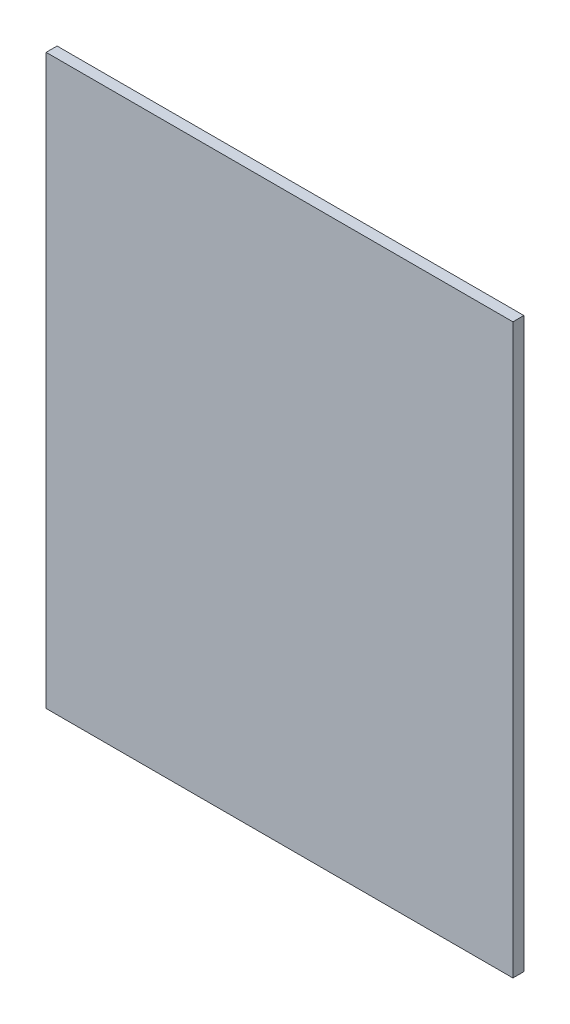
ISO-10303-21;
HEADER;
FILE_DESCRIPTION(('STEP AP214'),'2;1');
FILE_NAME('part.step','',(''),(''),'','','');
FILE_SCHEMA(('AUTOMOTIVE_DESIGN { 1 0 10303 214 1 1 1 1 }'));
ENDSEC;
DATA;
#1=APPLICATION_CONTEXT('core data for automotive mechanical design processes');
#2=APPLICATION_PROTOCOL_DEFINITION('international standard','automotive_design',2000,#1);
#3=PRODUCT_CONTEXT('',#1,'mechanical');
#4=PRODUCT('Part','Part','',(#3));
#5=PRODUCT_RELATED_PRODUCT_CATEGORY('part','',(#4));
#6=PRODUCT_DEFINITION_FORMATION('','',#4);
#7=PRODUCT_DEFINITION_CONTEXT('part definition',#1,'design');
#8=PRODUCT_DEFINITION('design','',#6,#7);
#9=PRODUCT_DEFINITION_SHAPE('','',#8);
#10=(LENGTH_UNIT() NAMED_UNIT(*) SI_UNIT(.MILLI.,.METRE.));
#11=(NAMED_UNIT(*) PLANE_ANGLE_UNIT() SI_UNIT($,.RADIAN.));
#12=(NAMED_UNIT(*) SI_UNIT($,.STERADIAN.) SOLID_ANGLE_UNIT());
#13=UNCERTAINTY_MEASURE_WITH_UNIT(LENGTH_MEASURE(1.E-05),#10,'distance_accuracy_value','');
#14=(GEOMETRIC_REPRESENTATION_CONTEXT(3) GLOBAL_UNCERTAINTY_ASSIGNED_CONTEXT((#13)) GLOBAL_UNIT_ASSIGNED_CONTEXT((#10,
#11,#12)) REPRESENTATION_CONTEXT('',''));
#15=CARTESIAN_POINT('',(0.,0.,0.));
#16=DIRECTION('',(0.,0.,1.));
#17=DIRECTION('',(1.,0.,0.));
#18=AXIS2_PLACEMENT_3D('',#15,#16,#17);
#19=CARTESIAN_POINT('',(151.884088258819,-292.926224711825,2.7));
#20=DIRECTION('',(-1.,0.,0.));
#21=DIRECTION('',(0.,0.,1.));
#22=AXIS2_PLACEMENT_3D('',#19,#20,#21);
#23=PLANE('',#22);
#24=DIRECTION('',(0.,1.,0.));
#25=VECTOR('',#24,1.);
#26=CARTESIAN_POINT('',(151.884088258819,-292.926224711825,0.));
#27=LINE('',#26,#25);
#28=CARTESIAN_POINT('',(151.884088258819,-432.926224711825,0.));
#29=VERTEX_POINT('',#28);
#30=CARTESIAN_POINT('',(151.884088258819,-292.926224711825,0.));
#31=VERTEX_POINT('',#30);
#32=EDGE_CURVE('E96',#29,#31,#27,.T.);
#33=ORIENTED_EDGE('',*,*,#32,.T.);
#34=DIRECTION('',(0.,0.,-1.));
#35=VECTOR('',#34,1.);
#36=CARTESIAN_POINT('',(151.884088258819,-292.926224711825,2.7));
#37=LINE('',#36,#35);
#38=CARTESIAN_POINT('',(151.884088258819,-292.926224711825,2.7));
#39=VERTEX_POINT('',#38);
#40=EDGE_CURVE('E11',#39,#31,#37,.T.);
#41=ORIENTED_EDGE('',*,*,#40,.F.);
#42=DIRECTION('',(0.,1.,0.));
#43=VECTOR('',#42,1.);
#44=CARTESIAN_POINT('',(151.884088258819,-292.926224711825,2.7));
#45=LINE('',#44,#43);
#46=CARTESIAN_POINT('',(151.884088258819,-432.926224711825,2.7));
#47=VERTEX_POINT('',#46);
#48=EDGE_CURVE('E84',#47,#39,#45,.T.);
#49=ORIENTED_EDGE('',*,*,#48,.F.);
#50=DIRECTION('',(0.,0.,-1.));
#51=VECTOR('',#50,1.);
#52=CARTESIAN_POINT('',(151.884088258819,-432.926224711825,2.7));
#53=LINE('',#52,#51);
#54=EDGE_CURVE('E92',#47,#29,#53,.T.);
#55=ORIENTED_EDGE('',*,*,#54,.T.);
#56=EDGE_LOOP('',(#33,#41,#49,#55));
#57=FACE_BOUND('',#56,.T.);
#58=ADVANCED_FACE('F33',(#57),#23,.F.);
#59=CARTESIAN_POINT('',(151.884088258819,-292.926224711825,2.7));
#60=DIRECTION('',(0.,-1.,0.));
#61=DIRECTION('',(0.,0.,-1.));
#62=AXIS2_PLACEMENT_3D('',#59,#60,#61);
#63=PLANE('',#62);
#64=DIRECTION('',(-1.,0.,0.));
#65=VECTOR('',#64,1.);
#66=CARTESIAN_POINT('',(151.884088258819,-292.926224711825,0.));
#67=LINE('',#66,#65);
#68=CARTESIAN_POINT('',(36.8840882588194,-292.926224711825,0.));
#69=VERTEX_POINT('',#68);
#70=EDGE_CURVE('E88',#31,#69,#67,.T.);
#71=ORIENTED_EDGE('',*,*,#70,.T.);
#72=DIRECTION('',(0.,0.,-1.));
#73=VECTOR('',#72,1.);
#74=CARTESIAN_POINT('',(36.8840882588194,-292.926224711825,2.7));
#75=LINE('',#74,#73);
#76=CARTESIAN_POINT('',(36.8840882588194,-292.926224711825,2.7));
#77=VERTEX_POINT('',#76);
#78=EDGE_CURVE('E41',#77,#69,#75,.T.);
#79=ORIENTED_EDGE('',*,*,#78,.F.);
#80=DIRECTION('',(-1.,0.,0.));
#81=VECTOR('',#80,1.);
#82=CARTESIAN_POINT('',(151.884088258819,-292.926224711825,2.7));
#83=LINE('',#82,#81);
#84=EDGE_CURVE('E79',#39,#77,#83,.T.);
#85=ORIENTED_EDGE('',*,*,#84,.F.);
#86=ORIENTED_EDGE('',*,*,#40,.T.);
#87=EDGE_LOOP('',(#71,#79,#85,#86));
#88=FACE_BOUND('',#87,.T.);
#89=ADVANCED_FACE('F87',(#88),#63,.F.);
#90=CARTESIAN_POINT('',(36.8840882588194,-292.926224711825,2.7));
#91=DIRECTION('',(1.,0.,0.));
#92=DIRECTION('',(0.,0.,-1.));
#93=AXIS2_PLACEMENT_3D('',#90,#91,#92);
#94=PLANE('',#93);
#95=DIRECTION('',(0.,-1.,0.));
#96=VECTOR('',#95,1.);
#97=CARTESIAN_POINT('',(36.8840882588194,-292.926224711825,0.));
#98=LINE('',#97,#96);
#99=CARTESIAN_POINT('',(36.8840882588194,-432.926224711825,0.));
#100=VERTEX_POINT('',#99);
#101=EDGE_CURVE('E66',#69,#100,#98,.T.);
#102=ORIENTED_EDGE('',*,*,#101,.T.);
#103=DIRECTION('',(0.,0.,-1.));
#104=VECTOR('',#103,1.);
#105=CARTESIAN_POINT('',(36.8840882588194,-432.926224711825,2.7));
#106=LINE('',#105,#104);
#107=CARTESIAN_POINT('',(36.8840882588194,-432.926224711825,2.7));
#108=VERTEX_POINT('',#107);
#109=EDGE_CURVE('E89',#108,#100,#106,.T.);
#110=ORIENTED_EDGE('',*,*,#109,.F.);
#111=DIRECTION('',(0.,-1.,0.));
#112=VECTOR('',#111,1.);
#113=CARTESIAN_POINT('',(36.8840882588194,-292.926224711825,2.7));
#114=LINE('',#113,#112);
#115=EDGE_CURVE('E82',#77,#108,#114,.T.);
#116=ORIENTED_EDGE('',*,*,#115,.F.);
#117=ORIENTED_EDGE('',*,*,#78,.T.);
#118=EDGE_LOOP('',(#102,#110,#116,#117));
#119=FACE_BOUND('',#118,.T.);
#120=ADVANCED_FACE('F90',(#119),#94,.F.);
#121=CARTESIAN_POINT('',(151.884088258819,-432.926224711825,2.7));
#122=DIRECTION('',(0.,1.,0.));
#123=DIRECTION('',(0.,0.,1.));
#124=AXIS2_PLACEMENT_3D('',#121,#122,#123);
#125=PLANE('',#124);
#126=DIRECTION('',(1.,0.,0.));
#127=VECTOR('',#126,1.);
#128=CARTESIAN_POINT('',(151.884088258819,-432.926224711825,0.));
#129=LINE('',#128,#127);
#130=EDGE_CURVE('E72',#100,#29,#129,.T.);
#131=ORIENTED_EDGE('',*,*,#130,.T.);
#132=ORIENTED_EDGE('',*,*,#54,.F.);
#133=DIRECTION('',(1.,0.,0.));
#134=VECTOR('',#133,1.);
#135=CARTESIAN_POINT('',(151.884088258819,-432.926224711825,2.7));
#136=LINE('',#135,#134);
#137=EDGE_CURVE('E49',#108,#47,#136,.T.);
#138=ORIENTED_EDGE('',*,*,#137,.F.);
#139=ORIENTED_EDGE('',*,*,#109,.T.);
#140=EDGE_LOOP('',(#131,#132,#138,#139));
#141=FACE_BOUND('',#140,.T.);
#142=ADVANCED_FACE('F103',(#141),#125,.F.);
#143=CARTESIAN_POINT('',(0.,0.,2.7));
#144=DIRECTION('',(0.,0.,-1.));
#145=DIRECTION('',(-1.,0.,0.));
#146=AXIS2_PLACEMENT_3D('',#143,#144,#145);
#147=PLANE('',#146);
#148=ORIENTED_EDGE('',*,*,#48,.T.);
#149=ORIENTED_EDGE('',*,*,#84,.T.);
#150=ORIENTED_EDGE('',*,*,#115,.T.);
#151=ORIENTED_EDGE('',*,*,#137,.T.);
#152=EDGE_LOOP('',(#148,#149,#150,#151));
#153=FACE_BOUND('',#152,.T.);
#154=ADVANCED_FACE('F80',(#153),#147,.F.);
#155=CARTESIAN_POINT('',(0.,0.,0.));
#156=DIRECTION('',(0.,0.,-1.));
#157=DIRECTION('',(-1.,0.,0.));
#158=AXIS2_PLACEMENT_3D('',#155,#156,#157);
#159=PLANE('',#158);
#160=ORIENTED_EDGE('',*,*,#32,.F.);
#161=ORIENTED_EDGE('',*,*,#130,.F.);
#162=ORIENTED_EDGE('',*,*,#101,.F.);
#163=ORIENTED_EDGE('',*,*,#70,.F.);
#164=EDGE_LOOP('',(#160,#161,#162,#163));
#165=FACE_BOUND('',#164,.T.);
#166=ADVANCED_FACE('F106',(#165),#159,.T.);
#167=CLOSED_SHELL('',(#58,#89,#120,#142,#154,#166));
#168=MANIFOLD_SOLID_BREP('B2',#167);
#169=ADVANCED_BREP_SHAPE_REPRESENTATION('',(#18,#168),#14);
#170=SHAPE_DEFINITION_REPRESENTATION(#9,#169);
ENDSEC;
END-ISO-10303-21;
